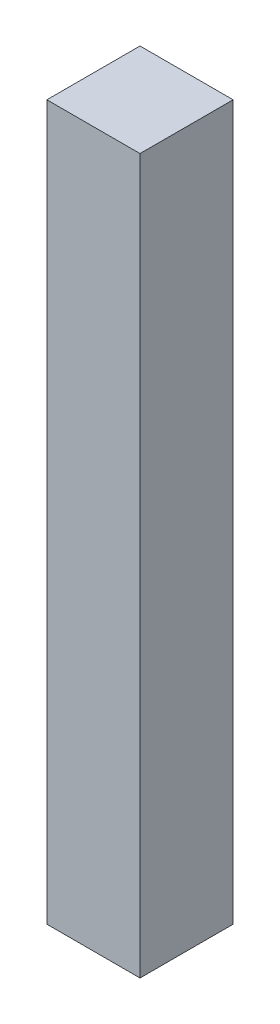
ISO-10303-21;
HEADER;
FILE_DESCRIPTION(('STEP AP214'),'2;1');
FILE_NAME('part.step','',(''),(''),'','','');
FILE_SCHEMA(('AUTOMOTIVE_DESIGN { 1 0 10303 214 1 1 1 1 }'));
ENDSEC;
DATA;
#1=APPLICATION_CONTEXT('core data for automotive mechanical design processes');
#2=APPLICATION_PROTOCOL_DEFINITION('international standard','automotive_design',2000,#1);
#3=PRODUCT_CONTEXT('',#1,'mechanical');
#4=PRODUCT('Part','Part','',(#3));
#5=PRODUCT_RELATED_PRODUCT_CATEGORY('part','',(#4));
#6=PRODUCT_DEFINITION_FORMATION('','',#4);
#7=PRODUCT_DEFINITION_CONTEXT('part definition',#1,'design');
#8=PRODUCT_DEFINITION('design','',#6,#7);
#9=PRODUCT_DEFINITION_SHAPE('','',#8);
#10=(LENGTH_UNIT() NAMED_UNIT(*) SI_UNIT(.MILLI.,.METRE.));
#11=(NAMED_UNIT(*) PLANE_ANGLE_UNIT() SI_UNIT($,.RADIAN.));
#12=(NAMED_UNIT(*) SI_UNIT($,.STERADIAN.) SOLID_ANGLE_UNIT());
#13=UNCERTAINTY_MEASURE_WITH_UNIT(LENGTH_MEASURE(1.E-05),#10,'distance_accuracy_value','');
#14=(GEOMETRIC_REPRESENTATION_CONTEXT(3) GLOBAL_UNCERTAINTY_ASSIGNED_CONTEXT((#13)) GLOBAL_UNIT_ASSIGNED_CONTEXT((#10,
#11,#12)) REPRESENTATION_CONTEXT('',''));
#15=CARTESIAN_POINT('',(0.,0.,0.));
#16=DIRECTION('',(0.,0.,1.));
#17=DIRECTION('',(1.,0.,0.));
#18=AXIS2_PLACEMENT_3D('',#15,#16,#17);
#19=CARTESIAN_POINT('',(15.,115.,15.));
#20=DIRECTION('',(-1.,0.,0.));
#21=DIRECTION('',(0.,0.,1.));
#22=AXIS2_PLACEMENT_3D('',#19,#20,#21);
#23=PLANE('',#22);
#24=DIRECTION('',(0.,0.,-1.));
#25=VECTOR('',#24,1.);
#26=CARTESIAN_POINT('',(15.,-115.,15.));
#27=LINE('',#26,#25);
#28=CARTESIAN_POINT('',(15.,-115.,15.));
#29=VERTEX_POINT('',#28);
#30=CARTESIAN_POINT('',(15.,-115.,-15.));
#31=VERTEX_POINT('',#30);
#32=EDGE_CURVE('E96',#29,#31,#27,.T.);
#33=ORIENTED_EDGE('',*,*,#32,.T.);
#34=DIRECTION('',(0.,-1.,0.));
#35=VECTOR('',#34,1.);
#36=CARTESIAN_POINT('',(15.,115.,-15.));
#37=LINE('',#36,#35);
#38=CARTESIAN_POINT('',(15.,115.,-15.));
#39=VERTEX_POINT('',#38);
#40=EDGE_CURVE('E11',#39,#31,#37,.T.);
#41=ORIENTED_EDGE('',*,*,#40,.F.);
#42=DIRECTION('',(0.,0.,-1.));
#43=VECTOR('',#42,1.);
#44=CARTESIAN_POINT('',(15.,115.,15.));
#45=LINE('',#44,#43);
#46=CARTESIAN_POINT('',(15.,115.,15.));
#47=VERTEX_POINT('',#46);
#48=EDGE_CURVE('E84',#47,#39,#45,.T.);
#49=ORIENTED_EDGE('',*,*,#48,.F.);
#50=DIRECTION('',(0.,-1.,0.));
#51=VECTOR('',#50,1.);
#52=CARTESIAN_POINT('',(15.,115.,15.));
#53=LINE('',#52,#51);
#54=EDGE_CURVE('E92',#47,#29,#53,.T.);
#55=ORIENTED_EDGE('',*,*,#54,.T.);
#56=EDGE_LOOP('',(#33,#41,#49,#55));
#57=FACE_BOUND('',#56,.T.);
#58=ADVANCED_FACE('F33',(#57),#23,.F.);
#59=CARTESIAN_POINT('',(-15.,115.,-15.));
#60=DIRECTION('',(0.,0.,1.));
#61=DIRECTION('',(1.,0.,0.));
#62=AXIS2_PLACEMENT_3D('',#59,#60,#61);
#63=PLANE('',#62);
#64=DIRECTION('',(-1.,0.,0.));
#65=VECTOR('',#64,1.);
#66=CARTESIAN_POINT('',(-15.,-115.,-15.));
#67=LINE('',#66,#65);
#68=CARTESIAN_POINT('',(-15.,-115.,-15.));
#69=VERTEX_POINT('',#68);
#70=EDGE_CURVE('E88',#31,#69,#67,.T.);
#71=ORIENTED_EDGE('',*,*,#70,.T.);
#72=DIRECTION('',(0.,-1.,0.));
#73=VECTOR('',#72,1.);
#74=CARTESIAN_POINT('',(-15.,115.,-15.));
#75=LINE('',#74,#73);
#76=CARTESIAN_POINT('',(-15.,115.,-15.));
#77=VERTEX_POINT('',#76);
#78=EDGE_CURVE('E41',#77,#69,#75,.T.);
#79=ORIENTED_EDGE('',*,*,#78,.F.);
#80=DIRECTION('',(-1.,0.,0.));
#81=VECTOR('',#80,1.);
#82=CARTESIAN_POINT('',(-15.,115.,-15.));
#83=LINE('',#82,#81);
#84=EDGE_CURVE('E79',#39,#77,#83,.T.);
#85=ORIENTED_EDGE('',*,*,#84,.F.);
#86=ORIENTED_EDGE('',*,*,#40,.T.);
#87=EDGE_LOOP('',(#71,#79,#85,#86));
#88=FACE_BOUND('',#87,.T.);
#89=ADVANCED_FACE('F87',(#88),#63,.F.);
#90=CARTESIAN_POINT('',(-15.,115.,15.));
#91=DIRECTION('',(1.,0.,0.));
#92=DIRECTION('',(0.,0.,-1.));
#93=AXIS2_PLACEMENT_3D('',#90,#91,#92);
#94=PLANE('',#93);
#95=DIRECTION('',(0.,0.,1.));
#96=VECTOR('',#95,1.);
#97=CARTESIAN_POINT('',(-15.,-115.,15.));
#98=LINE('',#97,#96);
#99=CARTESIAN_POINT('',(-15.,-115.,15.));
#100=VERTEX_POINT('',#99);
#101=EDGE_CURVE('E66',#69,#100,#98,.T.);
#102=ORIENTED_EDGE('',*,*,#101,.T.);
#103=DIRECTION('',(0.,-1.,0.));
#104=VECTOR('',#103,1.);
#105=CARTESIAN_POINT('',(-15.,115.,15.));
#106=LINE('',#105,#104);
#107=CARTESIAN_POINT('',(-15.,115.,15.));
#108=VERTEX_POINT('',#107);
#109=EDGE_CURVE('E89',#108,#100,#106,.T.);
#110=ORIENTED_EDGE('',*,*,#109,.F.);
#111=DIRECTION('',(0.,0.,1.));
#112=VECTOR('',#111,1.);
#113=CARTESIAN_POINT('',(-15.,115.,15.));
#114=LINE('',#113,#112);
#115=EDGE_CURVE('E82',#77,#108,#114,.T.);
#116=ORIENTED_EDGE('',*,*,#115,.F.);
#117=ORIENTED_EDGE('',*,*,#78,.T.);
#118=EDGE_LOOP('',(#102,#110,#116,#117));
#119=FACE_BOUND('',#118,.T.);
#120=ADVANCED_FACE('F90',(#119),#94,.F.);
#121=CARTESIAN_POINT('',(-15.,115.,15.));
#122=DIRECTION('',(0.,0.,-1.));
#123=DIRECTION('',(-1.,0.,0.));
#124=AXIS2_PLACEMENT_3D('',#121,#122,#123);
#125=PLANE('',#124);
#126=DIRECTION('',(1.,0.,0.));
#127=VECTOR('',#126,1.);
#128=CARTESIAN_POINT('',(-15.,-115.,15.));
#129=LINE('',#128,#127);
#130=EDGE_CURVE('E72',#100,#29,#129,.T.);
#131=ORIENTED_EDGE('',*,*,#130,.T.);
#132=ORIENTED_EDGE('',*,*,#54,.F.);
#133=DIRECTION('',(1.,0.,0.));
#134=VECTOR('',#133,1.);
#135=CARTESIAN_POINT('',(-15.,115.,15.));
#136=LINE('',#135,#134);
#137=EDGE_CURVE('E49',#108,#47,#136,.T.);
#138=ORIENTED_EDGE('',*,*,#137,.F.);
#139=ORIENTED_EDGE('',*,*,#109,.T.);
#140=EDGE_LOOP('',(#131,#132,#138,#139));
#141=FACE_BOUND('',#140,.T.);
#142=ADVANCED_FACE('F103',(#141),#125,.F.);
#143=CARTESIAN_POINT('',(0.,115.,0.));
#144=DIRECTION('',(0.,-1.,0.));
#145=DIRECTION('',(0.,0.,-1.));
#146=AXIS2_PLACEMENT_3D('',#143,#144,#145);
#147=PLANE('',#146);
#148=ORIENTED_EDGE('',*,*,#48,.T.);
#149=ORIENTED_EDGE('',*,*,#84,.T.);
#150=ORIENTED_EDGE('',*,*,#115,.T.);
#151=ORIENTED_EDGE('',*,*,#137,.T.);
#152=EDGE_LOOP('',(#148,#149,#150,#151));
#153=FACE_BOUND('',#152,.T.);
#154=ADVANCED_FACE('F80',(#153),#147,.F.);
#155=CARTESIAN_POINT('',(0.,-115.,0.));
#156=DIRECTION('',(0.,-1.,0.));
#157=DIRECTION('',(0.,0.,-1.));
#158=AXIS2_PLACEMENT_3D('',#155,#156,#157);
#159=PLANE('',#158);
#160=ORIENTED_EDGE('',*,*,#32,.F.);
#161=ORIENTED_EDGE('',*,*,#130,.F.);
#162=ORIENTED_EDGE('',*,*,#101,.F.);
#163=ORIENTED_EDGE('',*,*,#70,.F.);
#164=EDGE_LOOP('',(#160,#161,#162,#163));
#165=FACE_BOUND('',#164,.T.);
#166=ADVANCED_FACE('F106',(#165),#159,.T.);
#167=CLOSED_SHELL('',(#58,#89,#120,#142,#154,#166));
#168=MANIFOLD_SOLID_BREP('B2',#167);
#169=ADVANCED_BREP_SHAPE_REPRESENTATION('',(#18,#168),#14);
#170=SHAPE_DEFINITION_REPRESENTATION(#9,#169);
ENDSEC;
END-ISO-10303-21;
